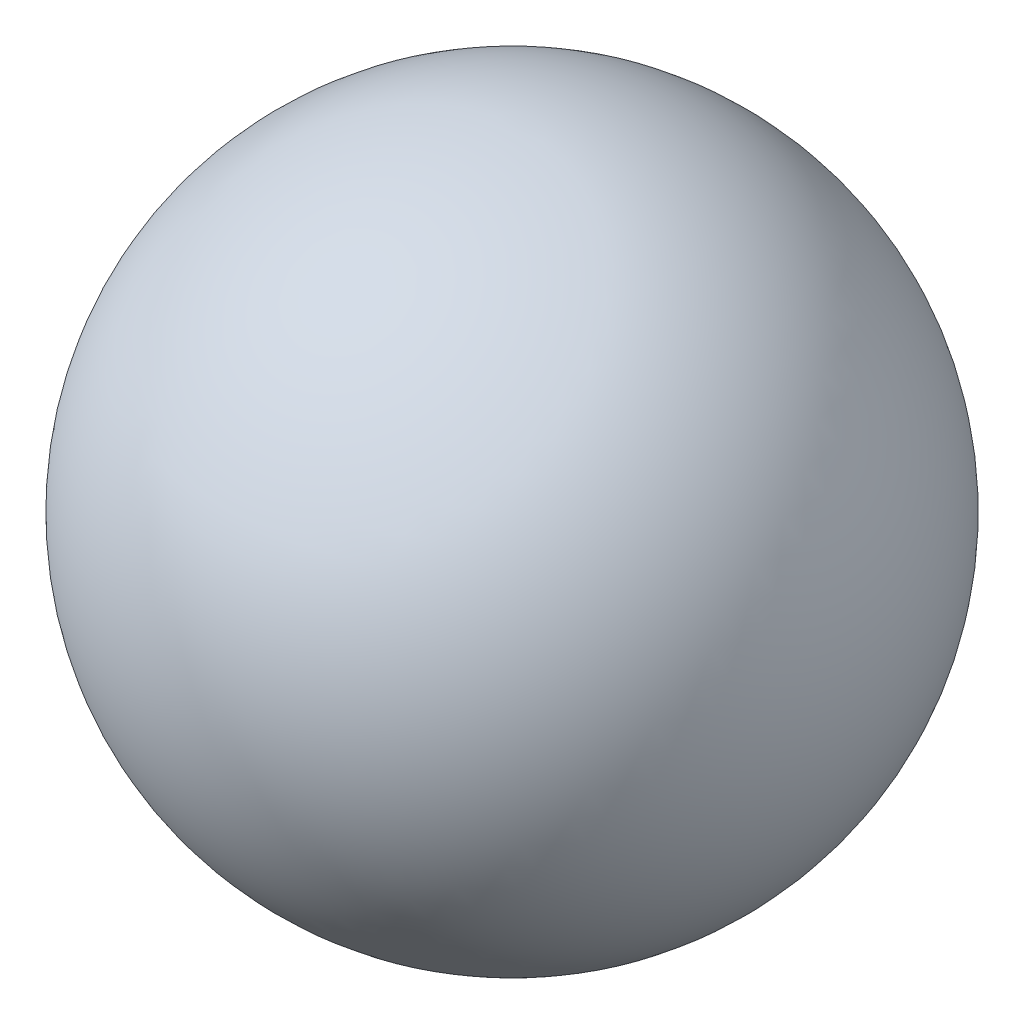
ISO-10303-21;
HEADER;
FILE_DESCRIPTION(('STEP AP214'),'2;1');
FILE_NAME('part.step','',(''),(''),'','','');
FILE_SCHEMA(('AUTOMOTIVE_DESIGN { 1 0 10303 214 1 1 1 1 }'));
ENDSEC;
DATA;
#1=APPLICATION_CONTEXT('core data for automotive mechanical design processes');
#2=APPLICATION_PROTOCOL_DEFINITION('international standard','automotive_design',2000,#1);
#3=PRODUCT_CONTEXT('',#1,'mechanical');
#4=PRODUCT('Part','Part','',(#3));
#5=PRODUCT_RELATED_PRODUCT_CATEGORY('part','',(#4));
#6=PRODUCT_DEFINITION_FORMATION('','',#4);
#7=PRODUCT_DEFINITION_CONTEXT('part definition',#1,'design');
#8=PRODUCT_DEFINITION('design','',#6,#7);
#9=PRODUCT_DEFINITION_SHAPE('','',#8);
#10=(LENGTH_UNIT() NAMED_UNIT(*) SI_UNIT(.MILLI.,.METRE.));
#11=(NAMED_UNIT(*) PLANE_ANGLE_UNIT() SI_UNIT($,.RADIAN.));
#12=(NAMED_UNIT(*) SI_UNIT($,.STERADIAN.) SOLID_ANGLE_UNIT());
#13=UNCERTAINTY_MEASURE_WITH_UNIT(LENGTH_MEASURE(1.E-05),#10,'distance_accuracy_value','');
#14=(GEOMETRIC_REPRESENTATION_CONTEXT(3) GLOBAL_UNCERTAINTY_ASSIGNED_CONTEXT((#13)) GLOBAL_UNIT_ASSIGNED_CONTEXT((#10,
#11,#12)) REPRESENTATION_CONTEXT('',''));
#15=CARTESIAN_POINT('',(0.,0.,0.));
#16=DIRECTION('',(0.,0.,1.));
#17=DIRECTION('',(1.,0.,0.));
#18=AXIS2_PLACEMENT_3D('',#15,#16,#17);
#19=CARTESIAN_POINT('',(0.,0.,0.));
#20=DIRECTION('',(0.,1.,0.));
#21=DIRECTION('',(1.,0.,0.));
#22=AXIS2_PLACEMENT_3D('',#19,#20,#21);
#23=SPHERICAL_SURFACE('',#22,94.2429626518479);
#24=CARTESIAN_POINT('',(0.,94.2429626518479,0.));
#25=VERTEX_POINT('',#24);
#26=VERTEX_LOOP('',#25);
#27=FACE_BOUND('',#26,.T.);
#28=ADVANCED_FACE('F31',(#27),#23,.T.);
#29=CLOSED_SHELL('',(#28));
#30=MANIFOLD_SOLID_BREP('B2',#29);
#31=ADVANCED_BREP_SHAPE_REPRESENTATION('',(#18,#30),#14);
#32=SHAPE_DEFINITION_REPRESENTATION(#9,#31);
ENDSEC;
END-ISO-10303-21;
